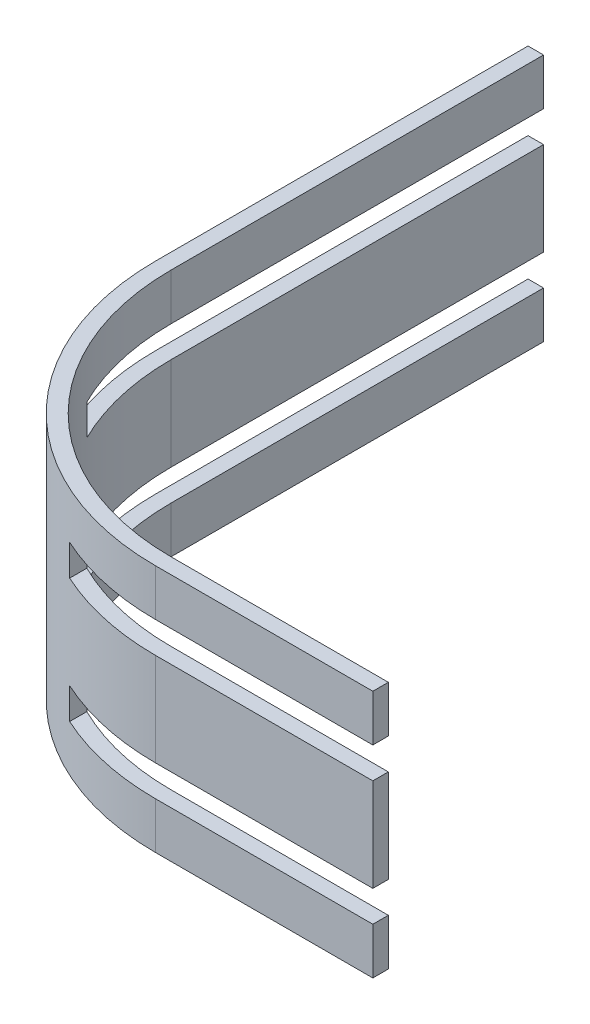
ISO-10303-21;
HEADER;
FILE_DESCRIPTION(('STEP AP214'),'2;1');
FILE_NAME('part.step','',(''),(''),'','','');
FILE_SCHEMA(('AUTOMOTIVE_DESIGN { 1 0 10303 214 1 1 1 1 }'));
ENDSEC;
DATA;
#1=APPLICATION_CONTEXT('core data for automotive mechanical design processes');
#2=APPLICATION_PROTOCOL_DEFINITION('international standard','automotive_design',2000,#1);
#3=PRODUCT_CONTEXT('',#1,'mechanical');
#4=PRODUCT('Part','Part','',(#3));
#5=PRODUCT_RELATED_PRODUCT_CATEGORY('part','',(#4));
#6=PRODUCT_DEFINITION_FORMATION('','',#4);
#7=PRODUCT_DEFINITION_CONTEXT('part definition',#1,'design');
#8=PRODUCT_DEFINITION('design','',#6,#7);
#9=PRODUCT_DEFINITION_SHAPE('','',#8);
#10=(LENGTH_UNIT() NAMED_UNIT(*) SI_UNIT(.MILLI.,.METRE.));
#11=(NAMED_UNIT(*) PLANE_ANGLE_UNIT() SI_UNIT($,.RADIAN.));
#12=(NAMED_UNIT(*) SI_UNIT($,.STERADIAN.) SOLID_ANGLE_UNIT());
#13=UNCERTAINTY_MEASURE_WITH_UNIT(LENGTH_MEASURE(1.E-05),#10,'distance_accuracy_value','');
#14=(GEOMETRIC_REPRESENTATION_CONTEXT(3) GLOBAL_UNCERTAINTY_ASSIGNED_CONTEXT((#13)) GLOBAL_UNIT_ASSIGNED_CONTEXT((#10,
#11,#12)) REPRESENTATION_CONTEXT('',''));
#15=CARTESIAN_POINT('',(0.,0.,0.));
#16=DIRECTION('',(0.,0.,1.));
#17=DIRECTION('',(1.,0.,0.));
#18=AXIS2_PLACEMENT_3D('',#15,#16,#17);
#19=CARTESIAN_POINT('',(1.,0.,4.));
#20=DIRECTION('',(0.,1.,0.));
#21=DIRECTION('',(0.,0.,1.));
#22=AXIS2_PLACEMENT_3D('',#19,#20,#21);
#23=PLANE('',#22);
#24=DIRECTION('',(1.,0.,0.));
#25=VECTOR('',#24,1.);
#26=CARTESIAN_POINT('',(-14.4578256879808,0.,11.075));
#27=LINE('',#26,#25);
#28=CARTESIAN_POINT('',(-14.4578256879808,0.,11.075));
#29=VERTEX_POINT('',#28);
#30=CARTESIAN_POINT('',(-13.3507621748812,0.,11.075));
#31=VERTEX_POINT('',#30);
#32=EDGE_CURVE('E54',#29,#31,#27,.T.);
#33=ORIENTED_EDGE('',*,*,#32,.F.);
#34=CARTESIAN_POINT('',(1.00000000000001,0.,4.));
#35=DIRECTION('',(0.,1.,0.));
#36=DIRECTION('',(0.,0.,1.));
#37=AXIS2_PLACEMENT_3D('',#34,#35,#36);
#38=CIRCLE('',#37,17.);
#39=CARTESIAN_POINT('',(-16.,0.,3.99999999999988));
#40=VERTEX_POINT('',#39);
#41=EDGE_CURVE('E657',#40,#29,#38,.T.);
#42=ORIENTED_EDGE('',*,*,#41,.F.);
#43=DIRECTION('',(0.,0.,1.));
#44=VECTOR('',#43,1.);
#45=CARTESIAN_POINT('',(-16.,0.,3.99999999999988));
#46=LINE('',#45,#44);
#47=CARTESIAN_POINT('',(-16.,0.,-20.));
#48=VERTEX_POINT('',#47);
#49=EDGE_CURVE('E654',#48,#40,#46,.T.);
#50=ORIENTED_EDGE('',*,*,#49,.F.);
#51=DIRECTION('',(-1.,0.,0.));
#52=VECTOR('',#51,1.);
#53=CARTESIAN_POINT('',(-16.,0.,-20.));
#54=LINE('',#53,#52);
#55=CARTESIAN_POINT('',(-15.,0.,-20.));
#56=VERTEX_POINT('',#55);
#57=EDGE_CURVE('E471',#56,#48,#54,.T.);
#58=ORIENTED_EDGE('',*,*,#57,.F.);
#59=DIRECTION('',(0.,0.,-1.));
#60=VECTOR('',#59,1.);
#61=CARTESIAN_POINT('',(-15.,0.,-20.));
#62=LINE('',#61,#60);
#63=CARTESIAN_POINT('',(-15.,0.,3.99999999999989));
#64=VERTEX_POINT('',#63);
#65=EDGE_CURVE('E488',#64,#56,#62,.T.);
#66=ORIENTED_EDGE('',*,*,#65,.F.);
#67=CARTESIAN_POINT('',(1.,0.,4.));
#68=DIRECTION('',(0.,-1.,0.));
#69=DIRECTION('',(0.,0.,1.));
#70=AXIS2_PLACEMENT_3D('',#67,#68,#69);
#71=CIRCLE('',#70,16.);
#72=EDGE_CURVE('E59',#31,#64,#71,.T.);
#73=ORIENTED_EDGE('',*,*,#72,.F.);
#74=EDGE_LOOP('',(#33,#42,#50,#58,#66,#73));
#75=FACE_BOUND('',#74,.T.);
#76=ADVANCED_FACE('F36',(#75),#23,.F.);
#77=DIRECTION('',(0.,0.,1.));
#78=VECTOR('',#77,1.);
#79=CARTESIAN_POINT('',(-6.075,0.,19.4578256879808));
#80=LINE('',#79,#78);
#81=CARTESIAN_POINT('',(-6.075,0.,18.3507621748812));
#82=VERTEX_POINT('',#81);
#83=CARTESIAN_POINT('',(-6.07499999999999,0.,19.4578256879808));
#84=VERTEX_POINT('',#83);
#85=EDGE_CURVE('E401',#82,#84,#80,.T.);
#86=ORIENTED_EDGE('',*,*,#85,.F.);
#87=CARTESIAN_POINT('',(1.00000000000012,0.,20.));
#88=VERTEX_POINT('',#87);
#89=EDGE_CURVE('E484',#88,#82,#71,.T.);
#90=ORIENTED_EDGE('',*,*,#89,.F.);
#91=DIRECTION('',(-1.,0.,0.));
#92=VECTOR('',#91,1.);
#93=CARTESIAN_POINT('',(1.00000000000012,0.,20.));
#94=LINE('',#93,#92);
#95=CARTESIAN_POINT('',(15.,0.,20.));
#96=VERTEX_POINT('',#95);
#97=EDGE_CURVE('E492',#96,#88,#94,.T.);
#98=ORIENTED_EDGE('',*,*,#97,.F.);
#99=DIRECTION('',(0.,0.,-1.));
#100=VECTOR('',#99,1.);
#101=CARTESIAN_POINT('',(15.,0.,20.));
#102=LINE('',#101,#100);
#103=CARTESIAN_POINT('',(15.,0.,21.));
#104=VERTEX_POINT('',#103);
#105=EDGE_CURVE('E658',#104,#96,#102,.T.);
#106=ORIENTED_EDGE('',*,*,#105,.F.);
#107=DIRECTION('',(1.,0.,0.));
#108=VECTOR('',#107,1.);
#109=CARTESIAN_POINT('',(15.,0.,21.));
#110=LINE('',#109,#108);
#111=CARTESIAN_POINT('',(1.00000000000013,0.,21.));
#112=VERTEX_POINT('',#111);
#113=EDGE_CURVE('E567',#112,#104,#110,.T.);
#114=ORIENTED_EDGE('',*,*,#113,.F.);
#115=EDGE_CURVE('E413',#84,#112,#38,.T.);
#116=ORIENTED_EDGE('',*,*,#115,.F.);
#117=EDGE_LOOP('',(#86,#90,#98,#106,#114,#116));
#118=FACE_BOUND('',#117,.T.);
#119=ADVANCED_FACE('F628',(#118),#23,.F.);
#120=CARTESIAN_POINT('',(1.,6.,4.));
#121=DIRECTION('',(0.,1.,0.));
#122=DIRECTION('',(0.,0.,1.));
#123=AXIS2_PLACEMENT_3D('',#120,#121,#122);
#124=PLANE('',#123);
#125=DIRECTION('',(-1.,0.,0.));
#126=VECTOR('',#125,1.);
#127=CARTESIAN_POINT('',(-14.4578256879808,6.,11.075));
#128=LINE('',#127,#126);
#129=CARTESIAN_POINT('',(-13.3507621748812,6.,11.075));
#130=VERTEX_POINT('',#129);
#131=CARTESIAN_POINT('',(-14.4578256879808,6.,11.075));
#132=VERTEX_POINT('',#131);
#133=EDGE_CURVE('E457',#130,#132,#128,.T.);
#134=ORIENTED_EDGE('',*,*,#133,.F.);
#135=CARTESIAN_POINT('',(1.,6.,4.));
#136=DIRECTION('',(0.,-1.,0.));
#137=DIRECTION('',(0.,0.,1.));
#138=AXIS2_PLACEMENT_3D('',#135,#136,#137);
#139=CIRCLE('',#138,16.);
#140=CARTESIAN_POINT('',(-15.,6.,3.99999999999989));
#141=VERTEX_POINT('',#140);
#142=EDGE_CURVE('E459',#130,#141,#139,.T.);
#143=ORIENTED_EDGE('',*,*,#142,.T.);
#144=DIRECTION('',(0.,0.,-1.));
#145=VECTOR('',#144,1.);
#146=CARTESIAN_POINT('',(-15.,6.,-20.));
#147=LINE('',#146,#145);
#148=CARTESIAN_POINT('',(-15.,6.,-20.));
#149=VERTEX_POINT('',#148);
#150=EDGE_CURVE('E501',#141,#149,#147,.T.);
#151=ORIENTED_EDGE('',*,*,#150,.T.);
#152=DIRECTION('',(-1.,0.,0.));
#153=VECTOR('',#152,1.);
#154=CARTESIAN_POINT('',(-16.,6.,-20.));
#155=LINE('',#154,#153);
#156=CARTESIAN_POINT('',(-16.,6.,-20.));
#157=VERTEX_POINT('',#156);
#158=EDGE_CURVE('E496',#149,#157,#155,.T.);
#159=ORIENTED_EDGE('',*,*,#158,.T.);
#160=DIRECTION('',(0.,0.,1.));
#161=VECTOR('',#160,1.);
#162=CARTESIAN_POINT('',(-16.,6.,3.99999999999988));
#163=LINE('',#162,#161);
#164=CARTESIAN_POINT('',(-16.,6.,3.99999999999988));
#165=VERTEX_POINT('',#164);
#166=EDGE_CURVE('E526',#157,#165,#163,.T.);
#167=ORIENTED_EDGE('',*,*,#166,.T.);
#168=CARTESIAN_POINT('',(1.00000000000001,6.,4.));
#169=DIRECTION('',(0.,1.,0.));
#170=DIRECTION('',(0.,0.,1.));
#171=AXIS2_PLACEMENT_3D('',#168,#169,#170);
#172=CIRCLE('',#171,17.);
#173=EDGE_CURVE('E518',#165,#132,#172,.T.);
#174=ORIENTED_EDGE('',*,*,#173,.T.);
#175=EDGE_LOOP('',(#134,#143,#151,#159,#167,#174));
#176=FACE_BOUND('',#175,.T.);
#177=ADVANCED_FACE('F542',(#176),#124,.T.);
#178=CARTESIAN_POINT('',(-16.,6.,-20.));
#179=DIRECTION('',(0.,0.,1.));
#180=DIRECTION('',(1.,0.,0.));
#181=AXIS2_PLACEMENT_3D('',#178,#179,#180);
#182=PLANE('',#181);
#183=ORIENTED_EDGE('',*,*,#57,.T.);
#184=DIRECTION('',(0.,-1.,0.));
#185=VECTOR('',#184,1.);
#186=CARTESIAN_POINT('',(-16.,6.,-20.));
#187=LINE('',#186,#185);
#188=EDGE_CURVE('E11',#157,#48,#187,.T.);
#189=ORIENTED_EDGE('',*,*,#188,.F.);
#190=ORIENTED_EDGE('',*,*,#158,.F.);
#191=DIRECTION('',(0.,-1.,0.));
#192=VECTOR('',#191,1.);
#193=CARTESIAN_POINT('',(-15.,6.,-20.));
#194=LINE('',#193,#192);
#195=EDGE_CURVE('E497',#149,#56,#194,.T.);
#196=ORIENTED_EDGE('',*,*,#195,.T.);
#197=EDGE_LOOP('',(#183,#189,#190,#196));
#198=FACE_BOUND('',#197,.T.);
#199=ADVANCED_FACE('F38',(#198),#182,.F.);
#200=CARTESIAN_POINT('',(-16.,6.,3.99999999999988));
#201=DIRECTION('',(1.,0.,0.));
#202=DIRECTION('',(0.,0.,-1.));
#203=AXIS2_PLACEMENT_3D('',#200,#201,#202);
#204=PLANE('',#203);
#205=ORIENTED_EDGE('',*,*,#49,.T.);
#206=DIRECTION('',(0.,-1.,0.));
#207=VECTOR('',#206,1.);
#208=CARTESIAN_POINT('',(-16.,6.,3.99999999999988));
#209=LINE('',#208,#207);
#210=EDGE_CURVE('E46',#165,#40,#209,.T.);
#211=ORIENTED_EDGE('',*,*,#210,.F.);
#212=ORIENTED_EDGE('',*,*,#166,.F.);
#213=ORIENTED_EDGE('',*,*,#188,.T.);
#214=EDGE_LOOP('',(#205,#211,#212,#213));
#215=FACE_BOUND('',#214,.T.);
#216=ADVANCED_FACE('F648',(#215),#204,.F.);
#217=CARTESIAN_POINT('',(1.00000000000001,6.,4.));
#218=DIRECTION('',(0.,-1.,0.));
#219=DIRECTION('',(0.,0.,-1.));
#220=AXIS2_PLACEMENT_3D('',#217,#218,#219);
#221=CYLINDRICAL_SURFACE('',#220,17.);
#222=ORIENTED_EDGE('',*,*,#41,.T.);
#223=DIRECTION('',(0.,1.,0.));
#224=VECTOR('',#223,1.);
#225=CARTESIAN_POINT('',(-14.4578256879808,-2.,11.075));
#226=LINE('',#225,#224);
#227=CARTESIAN_POINT('',(-14.4578256879808,-2.,11.075));
#228=VERTEX_POINT('',#227);
#229=EDGE_CURVE('E433',#228,#29,#226,.T.);
#230=ORIENTED_EDGE('',*,*,#229,.F.);
#231=CARTESIAN_POINT('',(1.00000000000001,-2.,4.));
#232=DIRECTION('',(0.,-1.,0.));
#233=DIRECTION('',(0.,0.,-1.));
#234=AXIS2_PLACEMENT_3D('',#231,#232,#233);
#235=CIRCLE('',#234,17.);
#236=CARTESIAN_POINT('',(-16.,-2.,3.99999999999988));
#237=VERTEX_POINT('',#236);
#238=EDGE_CURVE('E286',#228,#237,#235,.T.);
#239=ORIENTED_EDGE('',*,*,#238,.T.);
#240=DIRECTION('',(0.,1.,0.));
#241=VECTOR('',#240,1.);
#242=CARTESIAN_POINT('',(-16.,-5.,3.99999999999988));
#243=LINE('',#242,#241);
#244=CARTESIAN_POINT('',(-16.,-5.,3.99999999999988));
#245=VERTEX_POINT('',#244);
#246=EDGE_CURVE('E297',#245,#237,#243,.T.);
#247=ORIENTED_EDGE('',*,*,#246,.F.);
#248=CARTESIAN_POINT('',(1.00000000000001,-5.,4.));
#249=DIRECTION('',(0.,-1.,0.));
#250=DIRECTION('',(0.,0.,-1.));
#251=AXIS2_PLACEMENT_3D('',#248,#249,#250);
#252=CIRCLE('',#251,17.);
#253=CARTESIAN_POINT('',(1.00000000000013,-5.,21.));
#254=VERTEX_POINT('',#253);
#255=EDGE_CURVE('E680',#254,#245,#252,.T.);
#256=ORIENTED_EDGE('',*,*,#255,.F.);
#257=DIRECTION('',(0.,1.,0.));
#258=VECTOR('',#257,1.);
#259=CARTESIAN_POINT('',(1.00000000000013,-5.,21.));
#260=LINE('',#259,#258);
#261=CARTESIAN_POINT('',(1.00000000000013,-2.,21.));
#262=VERTEX_POINT('',#261);
#263=EDGE_CURVE('E300',#254,#262,#260,.T.);
#264=ORIENTED_EDGE('',*,*,#263,.T.);
#265=CARTESIAN_POINT('',(-6.07499999999999,-2.,19.4578256879808));
#266=VERTEX_POINT('',#265);
#267=EDGE_CURVE('E282',#262,#266,#235,.T.);
#268=ORIENTED_EDGE('',*,*,#267,.T.);
#269=DIRECTION('',(0.,1.,0.));
#270=VECTOR('',#269,1.);
#271=CARTESIAN_POINT('',(-6.07499999999999,-2.,19.4578256879808));
#272=LINE('',#271,#270);
#273=EDGE_CURVE('E416',#266,#84,#272,.T.);
#274=ORIENTED_EDGE('',*,*,#273,.T.);
#275=ORIENTED_EDGE('',*,*,#115,.T.);
#276=DIRECTION('',(0.,-1.,0.));
#277=VECTOR('',#276,1.);
#278=CARTESIAN_POINT('',(1.00000000000013,6.,21.));
#279=LINE('',#278,#277);
#280=CARTESIAN_POINT('',(1.00000000000013,6.,21.));
#281=VERTEX_POINT('',#280);
#282=EDGE_CURVE('E513',#281,#112,#279,.T.);
#283=ORIENTED_EDGE('',*,*,#282,.F.);
#284=CARTESIAN_POINT('',(-6.075,6.,19.4578256879808));
#285=VERTEX_POINT('',#284);
#286=EDGE_CURVE('E522',#285,#281,#172,.T.);
#287=ORIENTED_EDGE('',*,*,#286,.F.);
#288=DIRECTION('',(0.,-1.,0.));
#289=VECTOR('',#288,1.);
#290=CARTESIAN_POINT('',(-6.075,8.,19.4578256879808));
#291=LINE('',#290,#289);
#292=CARTESIAN_POINT('',(-6.075,8.,19.4578256879808));
#293=VERTEX_POINT('',#292);
#294=EDGE_CURVE('E465',#293,#285,#291,.T.);
#295=ORIENTED_EDGE('',*,*,#294,.F.);
#296=CARTESIAN_POINT('',(1.00000000000001,8.,4.));
#297=DIRECTION('',(0.,1.,0.));
#298=DIRECTION('',(0.,0.,1.));
#299=AXIS2_PLACEMENT_3D('',#296,#297,#298);
#300=CIRCLE('',#299,17.);
#301=CARTESIAN_POINT('',(1.00000000000013,8.,21.));
#302=VERTEX_POINT('',#301);
#303=EDGE_CURVE('E371',#293,#302,#300,.T.);
#304=ORIENTED_EDGE('',*,*,#303,.T.);
#305=DIRECTION('',(0.,-1.,0.));
#306=VECTOR('',#305,1.);
#307=CARTESIAN_POINT('',(1.00000000000013,11.,21.));
#308=LINE('',#307,#306);
#309=CARTESIAN_POINT('',(1.00000000000013,11.,21.));
#310=VERTEX_POINT('',#309);
#311=EDGE_CURVE('E354',#310,#302,#308,.T.);
#312=ORIENTED_EDGE('',*,*,#311,.F.);
#313=CARTESIAN_POINT('',(1.00000000000001,11.,4.));
#314=DIRECTION('',(0.,1.,0.));
#315=DIRECTION('',(0.,0.,1.));
#316=AXIS2_PLACEMENT_3D('',#313,#314,#315);
#317=CIRCLE('',#316,17.);
#318=CARTESIAN_POINT('',(-16.,11.,3.99999999999988));
#319=VERTEX_POINT('',#318);
#320=EDGE_CURVE('E353',#319,#310,#317,.T.);
#321=ORIENTED_EDGE('',*,*,#320,.F.);
#322=DIRECTION('',(0.,-1.,0.));
#323=VECTOR('',#322,1.);
#324=CARTESIAN_POINT('',(-16.,11.,3.99999999999988));
#325=LINE('',#324,#323);
#326=CARTESIAN_POINT('',(-16.,8.,3.99999999999988));
#327=VERTEX_POINT('',#326);
#328=EDGE_CURVE('E382',#319,#327,#325,.T.);
#329=ORIENTED_EDGE('',*,*,#328,.T.);
#330=CARTESIAN_POINT('',(-14.4578256879808,8.,11.075));
#331=VERTEX_POINT('',#330);
#332=EDGE_CURVE('E341',#327,#331,#300,.T.);
#333=ORIENTED_EDGE('',*,*,#332,.T.);
#334=DIRECTION('',(0.,-1.,0.));
#335=VECTOR('',#334,1.);
#336=CARTESIAN_POINT('',(-14.4578256879808,8.,11.075));
#337=LINE('',#336,#335);
#338=EDGE_CURVE('E444',#331,#132,#337,.T.);
#339=ORIENTED_EDGE('',*,*,#338,.T.);
#340=ORIENTED_EDGE('',*,*,#173,.F.);
#341=ORIENTED_EDGE('',*,*,#210,.T.);
#342=EDGE_LOOP('',(#222,#230,#239,#247,#256,#264,#268,#274,#275,#283,#287,#295,#304,#312,#321,
#329,#333,#339,#340,#341));
#343=FACE_BOUND('',#342,.T.);
#344=ADVANCED_FACE('F562',(#343),#221,.T.);
#345=CARTESIAN_POINT('',(15.,6.,21.));
#346=DIRECTION('',(0.,0.,-1.));
#347=DIRECTION('',(-1.,0.,0.));
#348=AXIS2_PLACEMENT_3D('',#345,#346,#347);
#349=PLANE('',#348);
#350=ORIENTED_EDGE('',*,*,#113,.T.);
#351=DIRECTION('',(0.,-1.,0.));
#352=VECTOR('',#351,1.);
#353=CARTESIAN_POINT('',(15.,6.,21.));
#354=LINE('',#353,#352);
#355=CARTESIAN_POINT('',(15.,6.,21.));
#356=VERTEX_POINT('',#355);
#357=EDGE_CURVE('E510',#356,#104,#354,.T.);
#358=ORIENTED_EDGE('',*,*,#357,.F.);
#359=DIRECTION('',(1.,0.,0.));
#360=VECTOR('',#359,1.);
#361=CARTESIAN_POINT('',(15.,6.,21.));
#362=LINE('',#361,#360);
#363=EDGE_CURVE('E521',#281,#356,#362,.T.);
#364=ORIENTED_EDGE('',*,*,#363,.F.);
#365=ORIENTED_EDGE('',*,*,#282,.T.);
#366=EDGE_LOOP('',(#350,#358,#364,#365));
#367=FACE_BOUND('',#366,.T.);
#368=ADVANCED_FACE('F565',(#367),#349,.F.);
#369=CARTESIAN_POINT('',(15.,6.,20.));
#370=DIRECTION('',(-1.,0.,0.));
#371=DIRECTION('',(0.,0.,1.));
#372=AXIS2_PLACEMENT_3D('',#369,#370,#371);
#373=PLANE('',#372);
#374=ORIENTED_EDGE('',*,*,#105,.T.);
#375=DIRECTION('',(0.,-1.,0.));
#376=VECTOR('',#375,1.);
#377=CARTESIAN_POINT('',(15.,6.,20.));
#378=LINE('',#377,#376);
#379=CARTESIAN_POINT('',(15.,6.,20.));
#380=VERTEX_POINT('',#379);
#381=EDGE_CURVE('E507',#380,#96,#378,.T.);
#382=ORIENTED_EDGE('',*,*,#381,.F.);
#383=DIRECTION('',(0.,0.,-1.));
#384=VECTOR('',#383,1.);
#385=CARTESIAN_POINT('',(15.,6.,20.));
#386=LINE('',#385,#384);
#387=EDGE_CURVE('E529',#356,#380,#386,.T.);
#388=ORIENTED_EDGE('',*,*,#387,.F.);
#389=ORIENTED_EDGE('',*,*,#357,.T.);
#390=EDGE_LOOP('',(#374,#382,#388,#389));
#391=FACE_BOUND('',#390,.T.);
#392=ADVANCED_FACE('F571',(#391),#373,.F.);
#393=CARTESIAN_POINT('',(1.00000000000012,6.,20.));
#394=DIRECTION('',(0.,0.,1.));
#395=DIRECTION('',(1.,0.,0.));
#396=AXIS2_PLACEMENT_3D('',#393,#394,#395);
#397=PLANE('',#396);
#398=ORIENTED_EDGE('',*,*,#97,.T.);
#399=DIRECTION('',(0.,-1.,0.));
#400=VECTOR('',#399,1.);
#401=CARTESIAN_POINT('',(1.00000000000012,6.,20.));
#402=LINE('',#401,#400);
#403=CARTESIAN_POINT('',(1.00000000000012,6.,20.));
#404=VERTEX_POINT('',#403);
#405=EDGE_CURVE('E504',#404,#88,#402,.T.);
#406=ORIENTED_EDGE('',*,*,#405,.F.);
#407=DIRECTION('',(-1.,0.,0.));
#408=VECTOR('',#407,1.);
#409=CARTESIAN_POINT('',(1.00000000000012,6.,20.));
#410=LINE('',#409,#408);
#411=EDGE_CURVE('E531',#380,#404,#410,.T.);
#412=ORIENTED_EDGE('',*,*,#411,.F.);
#413=ORIENTED_EDGE('',*,*,#381,.T.);
#414=EDGE_LOOP('',(#398,#406,#412,#413));
#415=FACE_BOUND('',#414,.T.);
#416=ADVANCED_FACE('F575',(#415),#397,.F.);
#417=CARTESIAN_POINT('',(1.,6.,4.));
#418=DIRECTION('',(0.,-1.,0.));
#419=DIRECTION('',(0.,0.,-1.));
#420=AXIS2_PLACEMENT_3D('',#417,#418,#419);
#421=CYLINDRICAL_SURFACE('',#420,16.);
#422=ORIENTED_EDGE('',*,*,#89,.T.);
#423=DIRECTION('',(0.,1.,0.));
#424=VECTOR('',#423,1.);
#425=CARTESIAN_POINT('',(-6.075,-2.,18.3507621748812));
#426=LINE('',#425,#424);
#427=CARTESIAN_POINT('',(-6.075,-2.,18.3507621748812));
#428=VERTEX_POINT('',#427);
#429=EDGE_CURVE('E458',#428,#82,#426,.T.);
#430=ORIENTED_EDGE('',*,*,#429,.F.);
#431=CARTESIAN_POINT('',(1.00000000000001,-2.,4.));
#432=DIRECTION('',(0.,1.,0.));
#433=DIRECTION('',(0.,0.,-1.));
#434=AXIS2_PLACEMENT_3D('',#431,#432,#433);
#435=CIRCLE('',#434,16.);
#436=CARTESIAN_POINT('',(1.00000000000012,-2.,20.));
#437=VERTEX_POINT('',#436);
#438=EDGE_CURVE('E323',#428,#437,#435,.T.);
#439=ORIENTED_EDGE('',*,*,#438,.T.);
#440=DIRECTION('',(0.,1.,0.));
#441=VECTOR('',#440,1.);
#442=CARTESIAN_POINT('',(1.00000000000012,-5.,20.));
#443=LINE('',#442,#441);
#444=CARTESIAN_POINT('',(1.00000000000012,-5.,20.));
#445=VERTEX_POINT('',#444);
#446=EDGE_CURVE('E278',#445,#437,#443,.T.);
#447=ORIENTED_EDGE('',*,*,#446,.F.);
#448=CARTESIAN_POINT('',(1.00000000000001,-5.,4.));
#449=DIRECTION('',(0.,1.,0.));
#450=DIRECTION('',(0.,0.,-1.));
#451=AXIS2_PLACEMENT_3D('',#448,#449,#450);
#452=CIRCLE('',#451,16.);
#453=CARTESIAN_POINT('',(-15.,-5.,3.99999999999989));
#454=VERTEX_POINT('',#453);
#455=EDGE_CURVE('E258',#454,#445,#452,.T.);
#456=ORIENTED_EDGE('',*,*,#455,.F.);
#457=DIRECTION('',(0.,1.,0.));
#458=VECTOR('',#457,1.);
#459=CARTESIAN_POINT('',(-15.,-5.,3.99999999999989));
#460=LINE('',#459,#458);
#461=CARTESIAN_POINT('',(-15.,-2.,3.99999999999989));
#462=VERTEX_POINT('',#461);
#463=EDGE_CURVE('E255',#454,#462,#460,.T.);
#464=ORIENTED_EDGE('',*,*,#463,.T.);
#465=CARTESIAN_POINT('',(-13.3507621748812,-2.,11.075));
#466=VERTEX_POINT('',#465);
#467=EDGE_CURVE('E326',#462,#466,#435,.T.);
#468=ORIENTED_EDGE('',*,*,#467,.T.);
#469=DIRECTION('',(0.,1.,0.));
#470=VECTOR('',#469,1.);
#471=CARTESIAN_POINT('',(-13.3507621748812,-2.,11.075));
#472=LINE('',#471,#470);
#473=EDGE_CURVE('E430',#466,#31,#472,.T.);
#474=ORIENTED_EDGE('',*,*,#473,.T.);
#475=ORIENTED_EDGE('',*,*,#72,.T.);
#476=DIRECTION('',(0.,-1.,0.));
#477=VECTOR('',#476,1.);
#478=CARTESIAN_POINT('',(-15.,6.,3.99999999999989));
#479=LINE('',#478,#477);
#480=EDGE_CURVE('E500',#141,#64,#479,.T.);
#481=ORIENTED_EDGE('',*,*,#480,.F.);
#482=ORIENTED_EDGE('',*,*,#142,.F.);
#483=DIRECTION('',(0.,-1.,0.));
#484=VECTOR('',#483,1.);
#485=CARTESIAN_POINT('',(-13.3507621748812,8.,11.075));
#486=LINE('',#485,#484);
#487=CARTESIAN_POINT('',(-13.3507621748812,8.,11.075));
#488=VERTEX_POINT('',#487);
#489=EDGE_CURVE('E466',#488,#130,#486,.T.);
#490=ORIENTED_EDGE('',*,*,#489,.F.);
#491=CARTESIAN_POINT('',(1.00000000000001,8.,4.));
#492=DIRECTION('',(0.,-1.,0.));
#493=DIRECTION('',(0.,0.,1.));
#494=AXIS2_PLACEMENT_3D('',#491,#492,#493);
#495=CIRCLE('',#494,16.);
#496=CARTESIAN_POINT('',(-15.,8.,3.99999999999988));
#497=VERTEX_POINT('',#496);
#498=EDGE_CURVE('E360',#488,#497,#495,.T.);
#499=ORIENTED_EDGE('',*,*,#498,.T.);
#500=DIRECTION('',(0.,-1.,0.));
#501=VECTOR('',#500,1.);
#502=CARTESIAN_POINT('',(-15.,11.,3.99999999999988));
#503=LINE('',#502,#501);
#504=CARTESIAN_POINT('',(-15.,11.,3.99999999999988));
#505=VERTEX_POINT('',#504);
#506=EDGE_CURVE('E391',#505,#497,#503,.T.);
#507=ORIENTED_EDGE('',*,*,#506,.F.);
#508=CARTESIAN_POINT('',(1.00000000000001,11.,4.));
#509=DIRECTION('',(0.,-1.,0.));
#510=DIRECTION('',(0.,0.,1.));
#511=AXIS2_PLACEMENT_3D('',#508,#509,#510);
#512=CIRCLE('',#511,16.);
#513=CARTESIAN_POINT('',(1.00000000000012,11.,20.));
#514=VERTEX_POINT('',#513);
#515=EDGE_CURVE('E345',#514,#505,#512,.T.);
#516=ORIENTED_EDGE('',*,*,#515,.F.);
#517=DIRECTION('',(0.,-1.,0.));
#518=VECTOR('',#517,1.);
#519=CARTESIAN_POINT('',(1.00000000000012,11.,20.));
#520=LINE('',#519,#518);
#521=CARTESIAN_POINT('',(1.00000000000012,8.,20.));
#522=VERTEX_POINT('',#521);
#523=EDGE_CURVE('E394',#514,#522,#520,.T.);
#524=ORIENTED_EDGE('',*,*,#523,.T.);
#525=CARTESIAN_POINT('',(-6.075,8.,18.3507621748812));
#526=VERTEX_POINT('',#525);
#527=EDGE_CURVE('E368',#522,#526,#495,.T.);
#528=ORIENTED_EDGE('',*,*,#527,.T.);
#529=DIRECTION('',(0.,-1.,0.));
#530=VECTOR('',#529,1.);
#531=CARTESIAN_POINT('',(-6.075,8.,18.3507621748812));
#532=LINE('',#531,#530);
#533=CARTESIAN_POINT('',(-6.075,6.,18.3507621748812));
#534=VERTEX_POINT('',#533);
#535=EDGE_CURVE('E462',#526,#534,#532,.T.);
#536=ORIENTED_EDGE('',*,*,#535,.T.);
#537=EDGE_CURVE('E536',#404,#534,#139,.T.);
#538=ORIENTED_EDGE('',*,*,#537,.F.);
#539=ORIENTED_EDGE('',*,*,#405,.T.);
#540=EDGE_LOOP('',(#422,#430,#439,#447,#456,#464,#468,#474,#475,#481,#482,#490,#499,#507,#516,
#524,#528,#536,#538,#539));
#541=FACE_BOUND('',#540,.T.);
#542=ADVANCED_FACE('F546',(#541),#421,.F.);
#543=CARTESIAN_POINT('',(-15.,6.,-20.));
#544=DIRECTION('',(-1.,0.,0.));
#545=DIRECTION('',(0.,0.,1.));
#546=AXIS2_PLACEMENT_3D('',#543,#544,#545);
#547=PLANE('',#546);
#548=ORIENTED_EDGE('',*,*,#65,.T.);
#549=ORIENTED_EDGE('',*,*,#195,.F.);
#550=ORIENTED_EDGE('',*,*,#150,.F.);
#551=ORIENTED_EDGE('',*,*,#480,.T.);
#552=EDGE_LOOP('',(#548,#549,#550,#551));
#553=FACE_BOUND('',#552,.T.);
#554=ADVANCED_FACE('F548',(#553),#547,.F.);
#555=DIRECTION('',(0.,0.,-1.));
#556=VECTOR('',#555,1.);
#557=CARTESIAN_POINT('',(-6.075,6.,18.3507621748812));
#558=LINE('',#557,#556);
#559=EDGE_CURVE('E453',#285,#534,#558,.T.);
#560=ORIENTED_EDGE('',*,*,#559,.F.);
#561=ORIENTED_EDGE('',*,*,#286,.T.);
#562=ORIENTED_EDGE('',*,*,#363,.T.);
#563=ORIENTED_EDGE('',*,*,#387,.T.);
#564=ORIENTED_EDGE('',*,*,#411,.T.);
#565=ORIENTED_EDGE('',*,*,#537,.T.);
#566=EDGE_LOOP('',(#560,#561,#562,#563,#564,#565));
#567=FACE_BOUND('',#566,.T.);
#568=ADVANCED_FACE('F557',(#567),#124,.T.);
#569=CARTESIAN_POINT('',(-6.075,8.,18.3507621748812));
#570=DIRECTION('',(-1.,0.,0.));
#571=DIRECTION('',(0.,0.,1.));
#572=AXIS2_PLACEMENT_3D('',#569,#570,#571);
#573=PLANE('',#572);
#574=ORIENTED_EDGE('',*,*,#559,.T.);
#575=ORIENTED_EDGE('',*,*,#535,.F.);
#576=DIRECTION('',(0.,0.,-1.));
#577=VECTOR('',#576,1.);
#578=CARTESIAN_POINT('',(-6.075,8.,18.3507621748812));
#579=LINE('',#578,#577);
#580=EDGE_CURVE('E445',#293,#526,#579,.T.);
#581=ORIENTED_EDGE('',*,*,#580,.F.);
#582=ORIENTED_EDGE('',*,*,#294,.T.);
#583=EDGE_LOOP('',(#574,#575,#581,#582));
#584=FACE_BOUND('',#583,.T.);
#585=ADVANCED_FACE('F580',(#584),#573,.F.);
#586=CARTESIAN_POINT('',(-14.4578256879808,8.,11.075));
#587=DIRECTION('',(0.,0.,1.));
#588=DIRECTION('',(1.,0.,0.));
#589=AXIS2_PLACEMENT_3D('',#586,#587,#588);
#590=PLANE('',#589);
#591=ORIENTED_EDGE('',*,*,#133,.T.);
#592=ORIENTED_EDGE('',*,*,#338,.F.);
#593=DIRECTION('',(-1.,0.,0.));
#594=VECTOR('',#593,1.);
#595=CARTESIAN_POINT('',(-14.4578256879808,8.,11.075));
#596=LINE('',#595,#594);
#597=EDGE_CURVE('E441',#488,#331,#596,.T.);
#598=ORIENTED_EDGE('',*,*,#597,.F.);
#599=ORIENTED_EDGE('',*,*,#489,.T.);
#600=EDGE_LOOP('',(#591,#592,#598,#599));
#601=FACE_BOUND('',#600,.T.);
#602=ADVANCED_FACE('F730',(#601),#590,.F.);
#603=CARTESIAN_POINT('',(-6.075,-2.,19.4578256879808));
#604=DIRECTION('',(-1.,0.,0.));
#605=DIRECTION('',(0.,0.,1.));
#606=AXIS2_PLACEMENT_3D('',#603,#604,#605);
#607=PLANE('',#606);
#608=ORIENTED_EDGE('',*,*,#85,.T.);
#609=ORIENTED_EDGE('',*,*,#273,.F.);
#610=DIRECTION('',(0.,0.,1.));
#611=VECTOR('',#610,1.);
#612=CARTESIAN_POINT('',(-6.075,-2.,19.4578256879808));
#613=LINE('',#612,#611);
#614=EDGE_CURVE('E40',#428,#266,#613,.T.);
#615=ORIENTED_EDGE('',*,*,#614,.F.);
#616=ORIENTED_EDGE('',*,*,#429,.T.);
#617=EDGE_LOOP('',(#608,#609,#615,#616));
#618=FACE_BOUND('',#617,.T.);
#619=ADVANCED_FACE('F663',(#618),#607,.F.);
#620=CARTESIAN_POINT('',(-14.4578256879808,-2.,11.075));
#621=DIRECTION('',(0.,0.,1.));
#622=DIRECTION('',(1.,0.,0.));
#623=AXIS2_PLACEMENT_3D('',#620,#621,#622);
#624=PLANE('',#623);
#625=ORIENTED_EDGE('',*,*,#32,.T.);
#626=ORIENTED_EDGE('',*,*,#473,.F.);
#627=DIRECTION('',(1.,0.,0.));
#628=VECTOR('',#627,1.);
#629=CARTESIAN_POINT('',(-14.4578256879808,-2.,11.075));
#630=LINE('',#629,#628);
#631=EDGE_CURVE('E434',#228,#466,#630,.T.);
#632=ORIENTED_EDGE('',*,*,#631,.F.);
#633=ORIENTED_EDGE('',*,*,#229,.T.);
#634=EDGE_LOOP('',(#625,#626,#632,#633));
#635=FACE_BOUND('',#634,.T.);
#636=ADVANCED_FACE('F624',(#635),#624,.F.);
#637=CARTESIAN_POINT('',(1.00000000000001,8.,4.));
#638=DIRECTION('',(0.,1.,0.));
#639=DIRECTION('',(0.,0.,1.));
#640=AXIS2_PLACEMENT_3D('',#637,#638,#639);
#641=PLANE('',#640);
#642=ORIENTED_EDGE('',*,*,#303,.F.);
#643=ORIENTED_EDGE('',*,*,#580,.T.);
#644=ORIENTED_EDGE('',*,*,#527,.F.);
#645=DIRECTION('',(-1.,0.,0.));
#646=VECTOR('',#645,1.);
#647=CARTESIAN_POINT('',(15.,8.,20.));
#648=LINE('',#647,#646);
#649=CARTESIAN_POINT('',(15.,8.,20.));
#650=VERTEX_POINT('',#649);
#651=EDGE_CURVE('E357',#650,#522,#648,.T.);
#652=ORIENTED_EDGE('',*,*,#651,.F.);
#653=DIRECTION('',(0.,0.,-1.));
#654=VECTOR('',#653,1.);
#655=CARTESIAN_POINT('',(15.,8.,21.));
#656=LINE('',#655,#654);
#657=CARTESIAN_POINT('',(15.,8.,21.));
#658=VERTEX_POINT('',#657);
#659=EDGE_CURVE('E276',#658,#650,#656,.T.);
#660=ORIENTED_EDGE('',*,*,#659,.F.);
#661=DIRECTION('',(1.,0.,0.));
#662=VECTOR('',#661,1.);
#663=CARTESIAN_POINT('',(1.00000000000013,8.,21.));
#664=LINE('',#663,#662);
#665=EDGE_CURVE('E273',#302,#658,#664,.T.);
#666=ORIENTED_EDGE('',*,*,#665,.F.);
#667=EDGE_LOOP('',(#642,#643,#644,#652,#660,#666));
#668=FACE_BOUND('',#667,.T.);
#669=ADVANCED_FACE('F583',(#668),#641,.F.);
#670=ORIENTED_EDGE('',*,*,#498,.F.);
#671=ORIENTED_EDGE('',*,*,#597,.T.);
#672=ORIENTED_EDGE('',*,*,#332,.F.);
#673=DIRECTION('',(0.,0.,1.));
#674=VECTOR('',#673,1.);
#675=CARTESIAN_POINT('',(-16.,8.,-20.));
#676=LINE('',#675,#674);
#677=CARTESIAN_POINT('',(-16.,8.,-20.));
#678=VERTEX_POINT('',#677);
#679=EDGE_CURVE('E374',#678,#327,#676,.T.);
#680=ORIENTED_EDGE('',*,*,#679,.F.);
#681=DIRECTION('',(-1.,0.,0.));
#682=VECTOR('',#681,1.);
#683=CARTESIAN_POINT('',(-15.,8.,-20.));
#684=LINE('',#683,#682);
#685=CARTESIAN_POINT('',(-15.,8.,-20.));
#686=VERTEX_POINT('',#685);
#687=EDGE_CURVE('E604',#686,#678,#684,.T.);
#688=ORIENTED_EDGE('',*,*,#687,.F.);
#689=DIRECTION('',(0.,0.,-1.));
#690=VECTOR('',#689,1.);
#691=CARTESIAN_POINT('',(-15.,8.,3.99999999999989));
#692=LINE('',#691,#690);
#693=EDGE_CURVE('E363',#497,#686,#692,.T.);
#694=ORIENTED_EDGE('',*,*,#693,.F.);
#695=EDGE_LOOP('',(#670,#671,#672,#680,#688,#694));
#696=FACE_BOUND('',#695,.T.);
#697=ADVANCED_FACE('F615',(#696),#641,.F.);
#698=CARTESIAN_POINT('',(1.00000000000013,11.,21.));
#699=DIRECTION('',(0.,0.,-1.));
#700=DIRECTION('',(-1.,0.,0.));
#701=AXIS2_PLACEMENT_3D('',#698,#699,#700);
#702=PLANE('',#701);
#703=ORIENTED_EDGE('',*,*,#665,.T.);
#704=DIRECTION('',(0.,-1.,0.));
#705=VECTOR('',#704,1.);
#706=CARTESIAN_POINT('',(15.,11.,21.));
#707=LINE('',#706,#705);
#708=CARTESIAN_POINT('',(15.,11.,21.));
#709=VERTEX_POINT('',#708);
#710=EDGE_CURVE('E399',#709,#658,#707,.T.);
#711=ORIENTED_EDGE('',*,*,#710,.F.);
#712=DIRECTION('',(1.,0.,0.));
#713=VECTOR('',#712,1.);
#714=CARTESIAN_POINT('',(1.00000000000013,11.,21.));
#715=LINE('',#714,#713);
#716=EDGE_CURVE('E337',#310,#709,#715,.T.);
#717=ORIENTED_EDGE('',*,*,#716,.F.);
#718=ORIENTED_EDGE('',*,*,#311,.T.);
#719=EDGE_LOOP('',(#703,#711,#717,#718));
#720=FACE_BOUND('',#719,.T.);
#721=ADVANCED_FACE('F590',(#720),#702,.F.);
#722=CARTESIAN_POINT('',(15.,11.,21.));
#723=DIRECTION('',(-1.,0.,0.));
#724=DIRECTION('',(0.,0.,1.));
#725=AXIS2_PLACEMENT_3D('',#722,#723,#724);
#726=PLANE('',#725);
#727=ORIENTED_EDGE('',*,*,#659,.T.);
#728=DIRECTION('',(0.,-1.,0.));
#729=VECTOR('',#728,1.);
#730=CARTESIAN_POINT('',(15.,11.,20.));
#731=LINE('',#730,#729);
#732=CARTESIAN_POINT('',(15.,11.,20.));
#733=VERTEX_POINT('',#732);
#734=EDGE_CURVE('E397',#733,#650,#731,.T.);
#735=ORIENTED_EDGE('',*,*,#734,.F.);
#736=DIRECTION('',(0.,0.,-1.));
#737=VECTOR('',#736,1.);
#738=CARTESIAN_POINT('',(15.,11.,21.));
#739=LINE('',#738,#737);
#740=EDGE_CURVE('E340',#709,#733,#739,.T.);
#741=ORIENTED_EDGE('',*,*,#740,.F.);
#742=ORIENTED_EDGE('',*,*,#710,.T.);
#743=EDGE_LOOP('',(#727,#735,#741,#742));
#744=FACE_BOUND('',#743,.T.);
#745=ADVANCED_FACE('F622',(#744),#726,.F.);
#746=CARTESIAN_POINT('',(15.,11.,20.));
#747=DIRECTION('',(0.,0.,1.));
#748=DIRECTION('',(1.,0.,0.));
#749=AXIS2_PLACEMENT_3D('',#746,#747,#748);
#750=PLANE('',#749);
#751=ORIENTED_EDGE('',*,*,#651,.T.);
#752=ORIENTED_EDGE('',*,*,#523,.F.);
#753=DIRECTION('',(-1.,0.,0.));
#754=VECTOR('',#753,1.);
#755=CARTESIAN_POINT('',(15.,11.,20.));
#756=LINE('',#755,#754);
#757=EDGE_CURVE('E343',#733,#514,#756,.T.);
#758=ORIENTED_EDGE('',*,*,#757,.F.);
#759=ORIENTED_EDGE('',*,*,#734,.T.);
#760=EDGE_LOOP('',(#751,#752,#758,#759));
#761=FACE_BOUND('',#760,.T.);
#762=ADVANCED_FACE('F720',(#761),#750,.F.);
#763=CARTESIAN_POINT('',(-15.,11.,3.99999999999989));
#764=DIRECTION('',(-1.,0.,0.));
#765=DIRECTION('',(0.,0.,1.));
#766=AXIS2_PLACEMENT_3D('',#763,#764,#765);
#767=PLANE('',#766);
#768=ORIENTED_EDGE('',*,*,#693,.T.);
#769=DIRECTION('',(0.,-1.,0.));
#770=VECTOR('',#769,1.);
#771=CARTESIAN_POINT('',(-15.,11.,-20.));
#772=LINE('',#771,#770);
#773=CARTESIAN_POINT('',(-15.,11.,-20.));
#774=VERTEX_POINT('',#773);
#775=EDGE_CURVE('E388',#774,#686,#772,.T.);
#776=ORIENTED_EDGE('',*,*,#775,.F.);
#777=DIRECTION('',(0.,0.,-1.));
#778=VECTOR('',#777,1.);
#779=CARTESIAN_POINT('',(-15.,11.,3.99999999999989));
#780=LINE('',#779,#778);
#781=EDGE_CURVE('E347',#505,#774,#780,.T.);
#782=ORIENTED_EDGE('',*,*,#781,.F.);
#783=ORIENTED_EDGE('',*,*,#506,.T.);
#784=EDGE_LOOP('',(#768,#776,#782,#783));
#785=FACE_BOUND('',#784,.T.);
#786=ADVANCED_FACE('F609',(#785),#767,.F.);
#787=CARTESIAN_POINT('',(-15.,11.,-20.));
#788=DIRECTION('',(0.,0.,1.));
#789=DIRECTION('',(1.,0.,0.));
#790=AXIS2_PLACEMENT_3D('',#787,#788,#789);
#791=PLANE('',#790);
#792=ORIENTED_EDGE('',*,*,#687,.T.);
#793=DIRECTION('',(0.,-1.,0.));
#794=VECTOR('',#793,1.);
#795=CARTESIAN_POINT('',(-16.,11.,-20.));
#796=LINE('',#795,#794);
#797=CARTESIAN_POINT('',(-16.,11.,-20.));
#798=VERTEX_POINT('',#797);
#799=EDGE_CURVE('E385',#798,#678,#796,.T.);
#800=ORIENTED_EDGE('',*,*,#799,.F.);
#801=DIRECTION('',(-1.,0.,0.));
#802=VECTOR('',#801,1.);
#803=CARTESIAN_POINT('',(-15.,11.,-20.));
#804=LINE('',#803,#802);
#805=EDGE_CURVE('E349',#774,#798,#804,.T.);
#806=ORIENTED_EDGE('',*,*,#805,.F.);
#807=ORIENTED_EDGE('',*,*,#775,.T.);
#808=EDGE_LOOP('',(#792,#800,#806,#807));
#809=FACE_BOUND('',#808,.T.);
#810=ADVANCED_FACE('F614',(#809),#791,.F.);
#811=CARTESIAN_POINT('',(-16.,11.,-20.));
#812=DIRECTION('',(1.,0.,0.));
#813=DIRECTION('',(0.,0.,-1.));
#814=AXIS2_PLACEMENT_3D('',#811,#812,#813);
#815=PLANE('',#814);
#816=ORIENTED_EDGE('',*,*,#679,.T.);
#817=ORIENTED_EDGE('',*,*,#328,.F.);
#818=DIRECTION('',(0.,0.,1.));
#819=VECTOR('',#818,1.);
#820=CARTESIAN_POINT('',(-16.,11.,-20.));
#821=LINE('',#820,#819);
#822=EDGE_CURVE('E351',#798,#319,#821,.T.);
#823=ORIENTED_EDGE('',*,*,#822,.F.);
#824=ORIENTED_EDGE('',*,*,#799,.T.);
#825=EDGE_LOOP('',(#816,#817,#823,#824));
#826=FACE_BOUND('',#825,.T.);
#827=ADVANCED_FACE('F599',(#826),#815,.F.);
#828=CARTESIAN_POINT('',(1.00000000000001,11.,4.));
#829=DIRECTION('',(0.,1.,0.));
#830=DIRECTION('',(0.,0.,1.));
#831=AXIS2_PLACEMENT_3D('',#828,#829,#830);
#832=PLANE('',#831);
#833=ORIENTED_EDGE('',*,*,#716,.T.);
#834=ORIENTED_EDGE('',*,*,#740,.T.);
#835=ORIENTED_EDGE('',*,*,#757,.T.);
#836=ORIENTED_EDGE('',*,*,#515,.T.);
#837=ORIENTED_EDGE('',*,*,#781,.T.);
#838=ORIENTED_EDGE('',*,*,#805,.T.);
#839=ORIENTED_EDGE('',*,*,#822,.T.);
#840=ORIENTED_EDGE('',*,*,#320,.T.);
#841=EDGE_LOOP('',(#833,#834,#835,#836,#837,#838,#839,#840));
#842=FACE_BOUND('',#841,.T.);
#843=ADVANCED_FACE('F592',(#842),#832,.T.);
#844=CARTESIAN_POINT('',(1.00000000000001,-2.,4.));
#845=DIRECTION('',(0.,-1.,0.));
#846=DIRECTION('',(0.,0.,-1.));
#847=AXIS2_PLACEMENT_3D('',#844,#845,#846);
#848=PLANE('',#847);
#849=ORIENTED_EDGE('',*,*,#438,.F.);
#850=ORIENTED_EDGE('',*,*,#614,.T.);
#851=ORIENTED_EDGE('',*,*,#267,.F.);
#852=DIRECTION('',(-1.,0.,0.));
#853=VECTOR('',#852,1.);
#854=CARTESIAN_POINT('',(1.00000000000013,-2.,21.));
#855=LINE('',#854,#853);
#856=CARTESIAN_POINT('',(15.,-2.,21.));
#857=VERTEX_POINT('',#856);
#858=EDGE_CURVE('E291',#857,#262,#855,.T.);
#859=ORIENTED_EDGE('',*,*,#858,.F.);
#860=DIRECTION('',(0.,0.,1.));
#861=VECTOR('',#860,1.);
#862=CARTESIAN_POINT('',(15.,-2.,21.));
#863=LINE('',#862,#861);
#864=CARTESIAN_POINT('',(15.,-2.,20.));
#865=VERTEX_POINT('',#864);
#866=EDGE_CURVE('E325',#865,#857,#863,.T.);
#867=ORIENTED_EDGE('',*,*,#866,.F.);
#868=DIRECTION('',(1.,0.,0.));
#869=VECTOR('',#868,1.);
#870=CARTESIAN_POINT('',(15.,-2.,20.));
#871=LINE('',#870,#869);
#872=EDGE_CURVE('E315',#437,#865,#871,.T.);
#873=ORIENTED_EDGE('',*,*,#872,.F.);
#874=EDGE_LOOP('',(#849,#850,#851,#859,#867,#873));
#875=FACE_BOUND('',#874,.T.);
#876=ADVANCED_FACE('F321',(#875),#848,.F.);
#877=ORIENTED_EDGE('',*,*,#238,.F.);
#878=ORIENTED_EDGE('',*,*,#631,.T.);
#879=ORIENTED_EDGE('',*,*,#467,.F.);
#880=DIRECTION('',(0.,0.,1.));
#881=VECTOR('',#880,1.);
#882=CARTESIAN_POINT('',(-15.,-2.,3.99999999999989));
#883=LINE('',#882,#881);
#884=CARTESIAN_POINT('',(-15.,-2.,-20.));
#885=VERTEX_POINT('',#884);
#886=EDGE_CURVE('E332',#885,#462,#883,.T.);
#887=ORIENTED_EDGE('',*,*,#886,.F.);
#888=DIRECTION('',(1.,0.,0.));
#889=VECTOR('',#888,1.);
#890=CARTESIAN_POINT('',(-15.,-2.,-20.));
#891=LINE('',#890,#889);
#892=CARTESIAN_POINT('',(-16.,-2.,-20.));
#893=VERTEX_POINT('',#892);
#894=EDGE_CURVE('E272',#893,#885,#891,.T.);
#895=ORIENTED_EDGE('',*,*,#894,.F.);
#896=DIRECTION('',(0.,0.,-1.));
#897=VECTOR('',#896,1.);
#898=CARTESIAN_POINT('',(-16.,-2.,-20.));
#899=LINE('',#898,#897);
#900=EDGE_CURVE('E268',#237,#893,#899,.T.);
#901=ORIENTED_EDGE('',*,*,#900,.F.);
#902=EDGE_LOOP('',(#877,#878,#879,#887,#895,#901));
#903=FACE_BOUND('',#902,.T.);
#904=ADVANCED_FACE('F670',(#903),#848,.F.);
#905=CARTESIAN_POINT('',(-15.,-5.,-20.));
#906=DIRECTION('',(0.,0.,1.));
#907=DIRECTION('',(1.,0.,0.));
#908=AXIS2_PLACEMENT_3D('',#905,#906,#907);
#909=PLANE('',#908);
#910=ORIENTED_EDGE('',*,*,#894,.T.);
#911=DIRECTION('',(0.,1.,0.));
#912=VECTOR('',#911,1.);
#913=CARTESIAN_POINT('',(-15.,-5.,-20.));
#914=LINE('',#913,#912);
#915=CARTESIAN_POINT('',(-15.,-5.,-20.));
#916=VERTEX_POINT('',#915);
#917=EDGE_CURVE('E252',#916,#885,#914,.T.);
#918=ORIENTED_EDGE('',*,*,#917,.F.);
#919=DIRECTION('',(1.,0.,0.));
#920=VECTOR('',#919,1.);
#921=CARTESIAN_POINT('',(-15.,-5.,-20.));
#922=LINE('',#921,#920);
#923=CARTESIAN_POINT('',(-16.,-5.,-20.));
#924=VERTEX_POINT('',#923);
#925=EDGE_CURVE('E259',#924,#916,#922,.T.);
#926=ORIENTED_EDGE('',*,*,#925,.F.);
#927=DIRECTION('',(0.,1.,0.));
#928=VECTOR('',#927,1.);
#929=CARTESIAN_POINT('',(-16.,-5.,-20.));
#930=LINE('',#929,#928);
#931=EDGE_CURVE('E295',#924,#893,#930,.T.);
#932=ORIENTED_EDGE('',*,*,#931,.T.);
#933=EDGE_LOOP('',(#910,#918,#926,#932));
#934=FACE_BOUND('',#933,.T.);
#935=ADVANCED_FACE('F270',(#934),#909,.F.);
#936=CARTESIAN_POINT('',(-15.,-5.,3.99999999999989));
#937=DIRECTION('',(-1.,0.,0.));
#938=DIRECTION('',(0.,0.,1.));
#939=AXIS2_PLACEMENT_3D('',#936,#937,#938);
#940=PLANE('',#939);
#941=ORIENTED_EDGE('',*,*,#886,.T.);
#942=ORIENTED_EDGE('',*,*,#463,.F.);
#943=DIRECTION('',(0.,0.,1.));
#944=VECTOR('',#943,1.);
#945=CARTESIAN_POINT('',(-15.,-5.,3.99999999999989));
#946=LINE('',#945,#944);
#947=EDGE_CURVE('E247',#916,#454,#946,.T.);
#948=ORIENTED_EDGE('',*,*,#947,.F.);
#949=ORIENTED_EDGE('',*,*,#917,.T.);
#950=EDGE_LOOP('',(#941,#942,#948,#949));
#951=FACE_BOUND('',#950,.T.);
#952=ADVANCED_FACE('F250',(#951),#940,.F.);
#953=CARTESIAN_POINT('',(15.,-5.,20.));
#954=DIRECTION('',(0.,0.,1.));
#955=DIRECTION('',(1.,0.,0.));
#956=AXIS2_PLACEMENT_3D('',#953,#954,#955);
#957=PLANE('',#956);
#958=ORIENTED_EDGE('',*,*,#872,.T.);
#959=DIRECTION('',(0.,1.,0.));
#960=VECTOR('',#959,1.);
#961=CARTESIAN_POINT('',(15.,-5.,20.));
#962=LINE('',#961,#960);
#963=CARTESIAN_POINT('',(15.,-5.,20.));
#964=VERTEX_POINT('',#963);
#965=EDGE_CURVE('E306',#964,#865,#962,.T.);
#966=ORIENTED_EDGE('',*,*,#965,.F.);
#967=DIRECTION('',(1.,0.,0.));
#968=VECTOR('',#967,1.);
#969=CARTESIAN_POINT('',(15.,-5.,20.));
#970=LINE('',#969,#968);
#971=EDGE_CURVE('E316',#445,#964,#970,.T.);
#972=ORIENTED_EDGE('',*,*,#971,.F.);
#973=ORIENTED_EDGE('',*,*,#446,.T.);
#974=EDGE_LOOP('',(#958,#966,#972,#973));
#975=FACE_BOUND('',#974,.T.);
#976=ADVANCED_FACE('F313',(#975),#957,.F.);
#977=CARTESIAN_POINT('',(15.,-5.,21.));
#978=DIRECTION('',(-1.,0.,0.));
#979=DIRECTION('',(0.,0.,1.));
#980=AXIS2_PLACEMENT_3D('',#977,#978,#979);
#981=PLANE('',#980);
#982=ORIENTED_EDGE('',*,*,#866,.T.);
#983=DIRECTION('',(0.,1.,0.));
#984=VECTOR('',#983,1.);
#985=CARTESIAN_POINT('',(15.,-5.,21.));
#986=LINE('',#985,#984);
#987=CARTESIAN_POINT('',(15.,-5.,21.));
#988=VERTEX_POINT('',#987);
#989=EDGE_CURVE('E303',#988,#857,#986,.T.);
#990=ORIENTED_EDGE('',*,*,#989,.F.);
#991=DIRECTION('',(0.,0.,1.));
#992=VECTOR('',#991,1.);
#993=CARTESIAN_POINT('',(15.,-5.,21.));
#994=LINE('',#993,#992);
#995=EDGE_CURVE('E674',#964,#988,#994,.T.);
#996=ORIENTED_EDGE('',*,*,#995,.F.);
#997=ORIENTED_EDGE('',*,*,#965,.T.);
#998=EDGE_LOOP('',(#982,#990,#996,#997));
#999=FACE_BOUND('',#998,.T.);
#1000=ADVANCED_FACE('F693',(#999),#981,.F.);
#1001=CARTESIAN_POINT('',(1.00000000000013,-5.,21.));
#1002=DIRECTION('',(0.,0.,-1.));
#1003=DIRECTION('',(-1.,0.,0.));
#1004=AXIS2_PLACEMENT_3D('',#1001,#1002,#1003);
#1005=PLANE('',#1004);
#1006=ORIENTED_EDGE('',*,*,#858,.T.);
#1007=ORIENTED_EDGE('',*,*,#263,.F.);
#1008=DIRECTION('',(-1.,0.,0.));
#1009=VECTOR('',#1008,1.);
#1010=CARTESIAN_POINT('',(1.00000000000013,-5.,21.));
#1011=LINE('',#1010,#1009);
#1012=EDGE_CURVE('E678',#988,#254,#1011,.T.);
#1013=ORIENTED_EDGE('',*,*,#1012,.F.);
#1014=ORIENTED_EDGE('',*,*,#989,.T.);
#1015=EDGE_LOOP('',(#1006,#1007,#1013,#1014));
#1016=FACE_BOUND('',#1015,.T.);
#1017=ADVANCED_FACE('F688',(#1016),#1005,.F.);
#1018=CARTESIAN_POINT('',(-16.,-5.,-20.));
#1019=DIRECTION('',(1.,0.,0.));
#1020=DIRECTION('',(0.,0.,-1.));
#1021=AXIS2_PLACEMENT_3D('',#1018,#1019,#1020);
#1022=PLANE('',#1021);
#1023=ORIENTED_EDGE('',*,*,#900,.T.);
#1024=ORIENTED_EDGE('',*,*,#931,.F.);
#1025=DIRECTION('',(0.,0.,-1.));
#1026=VECTOR('',#1025,1.);
#1027=CARTESIAN_POINT('',(-16.,-5.,-20.));
#1028=LINE('',#1027,#1026);
#1029=EDGE_CURVE('E264',#245,#924,#1028,.T.);
#1030=ORIENTED_EDGE('',*,*,#1029,.F.);
#1031=ORIENTED_EDGE('',*,*,#246,.T.);
#1032=EDGE_LOOP('',(#1023,#1024,#1030,#1031));
#1033=FACE_BOUND('',#1032,.T.);
#1034=ADVANCED_FACE('F683',(#1033),#1022,.F.);
#1035=CARTESIAN_POINT('',(1.00000000000001,-5.,4.));
#1036=DIRECTION('',(0.,-1.,0.));
#1037=DIRECTION('',(0.,0.,-1.));
#1038=AXIS2_PLACEMENT_3D('',#1035,#1036,#1037);
#1039=PLANE('',#1038);
#1040=ORIENTED_EDGE('',*,*,#925,.T.);
#1041=ORIENTED_EDGE('',*,*,#947,.T.);
#1042=ORIENTED_EDGE('',*,*,#455,.T.);
#1043=ORIENTED_EDGE('',*,*,#971,.T.);
#1044=ORIENTED_EDGE('',*,*,#995,.T.);
#1045=ORIENTED_EDGE('',*,*,#1012,.T.);
#1046=ORIENTED_EDGE('',*,*,#255,.T.);
#1047=ORIENTED_EDGE('',*,*,#1029,.T.);
#1048=EDGE_LOOP('',(#1040,#1041,#1042,#1043,#1044,#1045,#1046,#1047));
#1049=FACE_BOUND('',#1048,.T.);
#1050=ADVANCED_FACE('F262',(#1049),#1039,.T.);
#1051=CLOSED_SHELL('',(#76,#119,#177,#199,#216,#344,#368,#392,#416,#542,#554,#568,#585,#602,
#619,#636,#669,#697,#721,#745,#762,#786,#810,#827,#843,#876,#904,#935,#952,#976,#1000,#1017,
#1034,#1050));
#1052=MANIFOLD_SOLID_BREP('B2',#1051);
#1053=ADVANCED_BREP_SHAPE_REPRESENTATION('',(#18,#1052),#14);
#1054=SHAPE_DEFINITION_REPRESENTATION(#9,#1053);
ENDSEC;
END-ISO-10303-21;
